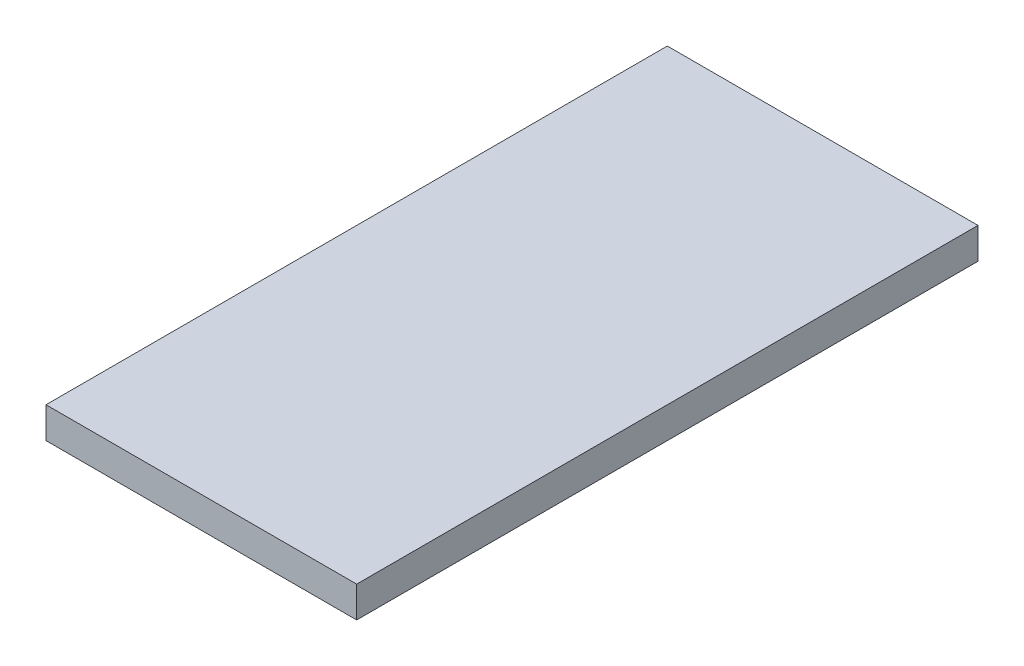
ISO-10303-21;
HEADER;
FILE_DESCRIPTION(('STEP AP214'),'2;1');
FILE_NAME('part.step','',(''),(''),'','','');
FILE_SCHEMA(('AUTOMOTIVE_DESIGN { 1 0 10303 214 1 1 1 1 }'));
ENDSEC;
DATA;
#1=APPLICATION_CONTEXT('core data for automotive mechanical design processes');
#2=APPLICATION_PROTOCOL_DEFINITION('international standard','automotive_design',2000,#1);
#3=PRODUCT_CONTEXT('',#1,'mechanical');
#4=PRODUCT('Part','Part','',(#3));
#5=PRODUCT_RELATED_PRODUCT_CATEGORY('part','',(#4));
#6=PRODUCT_DEFINITION_FORMATION('','',#4);
#7=PRODUCT_DEFINITION_CONTEXT('part definition',#1,'design');
#8=PRODUCT_DEFINITION('design','',#6,#7);
#9=PRODUCT_DEFINITION_SHAPE('','',#8);
#10=(LENGTH_UNIT() NAMED_UNIT(*) SI_UNIT(.MILLI.,.METRE.));
#11=(NAMED_UNIT(*) PLANE_ANGLE_UNIT() SI_UNIT($,.RADIAN.));
#12=(NAMED_UNIT(*) SI_UNIT($,.STERADIAN.) SOLID_ANGLE_UNIT());
#13=UNCERTAINTY_MEASURE_WITH_UNIT(LENGTH_MEASURE(1.E-05),#10,'distance_accuracy_value','');
#14=(GEOMETRIC_REPRESENTATION_CONTEXT(3) GLOBAL_UNCERTAINTY_ASSIGNED_CONTEXT((#13)) GLOBAL_UNIT_ASSIGNED_CONTEXT((#10,
#11,#12)) REPRESENTATION_CONTEXT('',''));
#15=CARTESIAN_POINT('',(0.,0.,0.));
#16=DIRECTION('',(0.,0.,1.));
#17=DIRECTION('',(1.,0.,0.));
#18=AXIS2_PLACEMENT_3D('',#15,#16,#17);
#19=CARTESIAN_POINT('',(10.,2.,20.));
#20=DIRECTION('',(-1.,0.,0.));
#21=DIRECTION('',(0.,0.,1.));
#22=AXIS2_PLACEMENT_3D('',#19,#20,#21);
#23=PLANE('',#22);
#24=DIRECTION('',(0.,0.,-1.));
#25=VECTOR('',#24,1.);
#26=CARTESIAN_POINT('',(10.,0.,20.));
#27=LINE('',#26,#25);
#28=CARTESIAN_POINT('',(10.,0.,20.));
#29=VERTEX_POINT('',#28);
#30=CARTESIAN_POINT('',(10.,0.,-20.));
#31=VERTEX_POINT('',#30);
#32=EDGE_CURVE('E96',#29,#31,#27,.T.);
#33=ORIENTED_EDGE('',*,*,#32,.T.);
#34=DIRECTION('',(0.,-1.,0.));
#35=VECTOR('',#34,1.);
#36=CARTESIAN_POINT('',(10.,2.,-20.));
#37=LINE('',#36,#35);
#38=CARTESIAN_POINT('',(10.,2.,-20.));
#39=VERTEX_POINT('',#38);
#40=EDGE_CURVE('E11',#39,#31,#37,.T.);
#41=ORIENTED_EDGE('',*,*,#40,.F.);
#42=DIRECTION('',(0.,0.,-1.));
#43=VECTOR('',#42,1.);
#44=CARTESIAN_POINT('',(10.,2.,20.));
#45=LINE('',#44,#43);
#46=CARTESIAN_POINT('',(10.,2.,20.));
#47=VERTEX_POINT('',#46);
#48=EDGE_CURVE('E84',#47,#39,#45,.T.);
#49=ORIENTED_EDGE('',*,*,#48,.F.);
#50=DIRECTION('',(0.,-1.,0.));
#51=VECTOR('',#50,1.);
#52=CARTESIAN_POINT('',(10.,2.,20.));
#53=LINE('',#52,#51);
#54=EDGE_CURVE('E92',#47,#29,#53,.T.);
#55=ORIENTED_EDGE('',*,*,#54,.T.);
#56=EDGE_LOOP('',(#33,#41,#49,#55));
#57=FACE_BOUND('',#56,.T.);
#58=ADVANCED_FACE('F33',(#57),#23,.F.);
#59=CARTESIAN_POINT('',(-10.,2.,-20.));
#60=DIRECTION('',(0.,0.,1.));
#61=DIRECTION('',(1.,0.,0.));
#62=AXIS2_PLACEMENT_3D('',#59,#60,#61);
#63=PLANE('',#62);
#64=DIRECTION('',(-1.,0.,0.));
#65=VECTOR('',#64,1.);
#66=CARTESIAN_POINT('',(-10.,0.,-20.));
#67=LINE('',#66,#65);
#68=CARTESIAN_POINT('',(-10.,0.,-20.));
#69=VERTEX_POINT('',#68);
#70=EDGE_CURVE('E88',#31,#69,#67,.T.);
#71=ORIENTED_EDGE('',*,*,#70,.T.);
#72=DIRECTION('',(0.,-1.,0.));
#73=VECTOR('',#72,1.);
#74=CARTESIAN_POINT('',(-10.,2.,-20.));
#75=LINE('',#74,#73);
#76=CARTESIAN_POINT('',(-10.,2.,-20.));
#77=VERTEX_POINT('',#76);
#78=EDGE_CURVE('E41',#77,#69,#75,.T.);
#79=ORIENTED_EDGE('',*,*,#78,.F.);
#80=DIRECTION('',(-1.,0.,0.));
#81=VECTOR('',#80,1.);
#82=CARTESIAN_POINT('',(-10.,2.,-20.));
#83=LINE('',#82,#81);
#84=EDGE_CURVE('E79',#39,#77,#83,.T.);
#85=ORIENTED_EDGE('',*,*,#84,.F.);
#86=ORIENTED_EDGE('',*,*,#40,.T.);
#87=EDGE_LOOP('',(#71,#79,#85,#86));
#88=FACE_BOUND('',#87,.T.);
#89=ADVANCED_FACE('F87',(#88),#63,.F.);
#90=CARTESIAN_POINT('',(-10.,2.,20.));
#91=DIRECTION('',(1.,0.,0.));
#92=DIRECTION('',(0.,0.,-1.));
#93=AXIS2_PLACEMENT_3D('',#90,#91,#92);
#94=PLANE('',#93);
#95=DIRECTION('',(0.,0.,1.));
#96=VECTOR('',#95,1.);
#97=CARTESIAN_POINT('',(-10.,0.,20.));
#98=LINE('',#97,#96);
#99=CARTESIAN_POINT('',(-10.,0.,20.));
#100=VERTEX_POINT('',#99);
#101=EDGE_CURVE('E66',#69,#100,#98,.T.);
#102=ORIENTED_EDGE('',*,*,#101,.T.);
#103=DIRECTION('',(0.,-1.,0.));
#104=VECTOR('',#103,1.);
#105=CARTESIAN_POINT('',(-10.,2.,20.));
#106=LINE('',#105,#104);
#107=CARTESIAN_POINT('',(-10.,2.,20.));
#108=VERTEX_POINT('',#107);
#109=EDGE_CURVE('E89',#108,#100,#106,.T.);
#110=ORIENTED_EDGE('',*,*,#109,.F.);
#111=DIRECTION('',(0.,0.,1.));
#112=VECTOR('',#111,1.);
#113=CARTESIAN_POINT('',(-10.,2.,20.));
#114=LINE('',#113,#112);
#115=EDGE_CURVE('E82',#77,#108,#114,.T.);
#116=ORIENTED_EDGE('',*,*,#115,.F.);
#117=ORIENTED_EDGE('',*,*,#78,.T.);
#118=EDGE_LOOP('',(#102,#110,#116,#117));
#119=FACE_BOUND('',#118,.T.);
#120=ADVANCED_FACE('F90',(#119),#94,.F.);
#121=CARTESIAN_POINT('',(-10.,2.,20.));
#122=DIRECTION('',(0.,0.,-1.));
#123=DIRECTION('',(-1.,0.,0.));
#124=AXIS2_PLACEMENT_3D('',#121,#122,#123);
#125=PLANE('',#124);
#126=DIRECTION('',(1.,0.,0.));
#127=VECTOR('',#126,1.);
#128=CARTESIAN_POINT('',(-10.,0.,20.));
#129=LINE('',#128,#127);
#130=EDGE_CURVE('E72',#100,#29,#129,.T.);
#131=ORIENTED_EDGE('',*,*,#130,.T.);
#132=ORIENTED_EDGE('',*,*,#54,.F.);
#133=DIRECTION('',(1.,0.,0.));
#134=VECTOR('',#133,1.);
#135=CARTESIAN_POINT('',(-10.,2.,20.));
#136=LINE('',#135,#134);
#137=EDGE_CURVE('E49',#108,#47,#136,.T.);
#138=ORIENTED_EDGE('',*,*,#137,.F.);
#139=ORIENTED_EDGE('',*,*,#109,.T.);
#140=EDGE_LOOP('',(#131,#132,#138,#139));
#141=FACE_BOUND('',#140,.T.);
#142=ADVANCED_FACE('F103',(#141),#125,.F.);
#143=CARTESIAN_POINT('',(0.,2.,0.));
#144=DIRECTION('',(0.,-1.,0.));
#145=DIRECTION('',(0.,0.,-1.));
#146=AXIS2_PLACEMENT_3D('',#143,#144,#145);
#147=PLANE('',#146);
#148=ORIENTED_EDGE('',*,*,#48,.T.);
#149=ORIENTED_EDGE('',*,*,#84,.T.);
#150=ORIENTED_EDGE('',*,*,#115,.T.);
#151=ORIENTED_EDGE('',*,*,#137,.T.);
#152=EDGE_LOOP('',(#148,#149,#150,#151));
#153=FACE_BOUND('',#152,.T.);
#154=ADVANCED_FACE('F80',(#153),#147,.F.);
#155=CARTESIAN_POINT('',(0.,0.,0.));
#156=DIRECTION('',(0.,-1.,0.));
#157=DIRECTION('',(0.,0.,-1.));
#158=AXIS2_PLACEMENT_3D('',#155,#156,#157);
#159=PLANE('',#158);
#160=ORIENTED_EDGE('',*,*,#32,.F.);
#161=ORIENTED_EDGE('',*,*,#130,.F.);
#162=ORIENTED_EDGE('',*,*,#101,.F.);
#163=ORIENTED_EDGE('',*,*,#70,.F.);
#164=EDGE_LOOP('',(#160,#161,#162,#163));
#165=FACE_BOUND('',#164,.T.);
#166=ADVANCED_FACE('F106',(#165),#159,.T.);
#167=CLOSED_SHELL('',(#58,#89,#120,#142,#154,#166));
#168=MANIFOLD_SOLID_BREP('B2',#167);
#169=ADVANCED_BREP_SHAPE_REPRESENTATION('',(#18,#168),#14);
#170=SHAPE_DEFINITION_REPRESENTATION(#9,#169);
ENDSEC;
END-ISO-10303-21;
